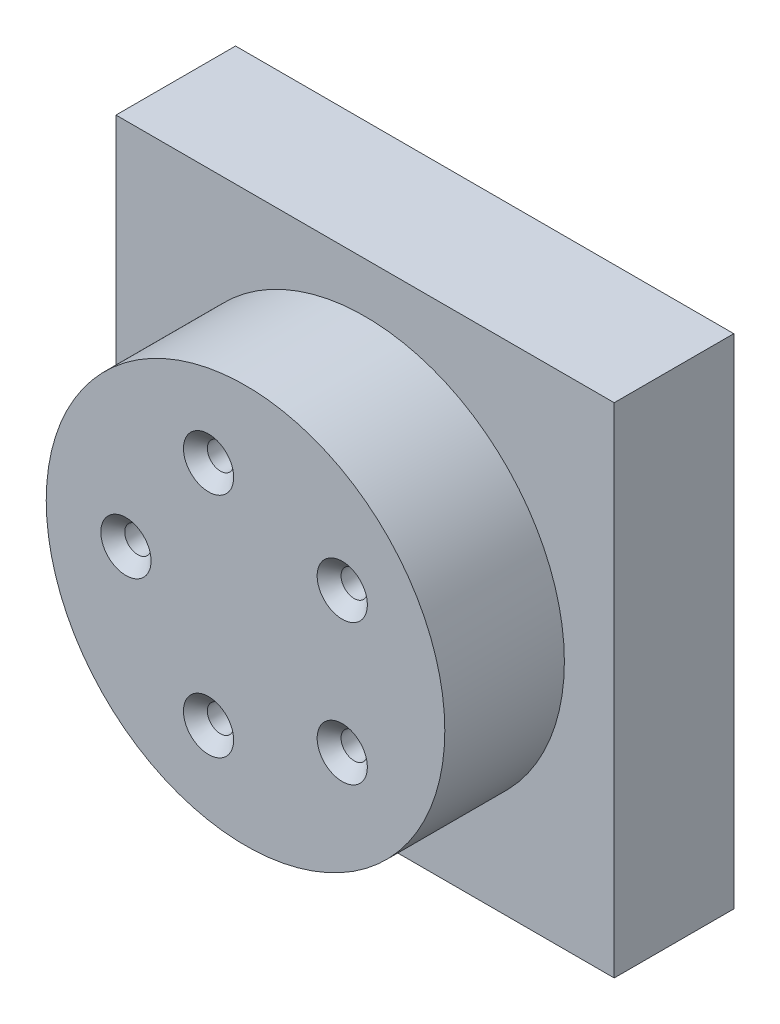
ISO-10303-21;
HEADER;
FILE_DESCRIPTION(('STEP AP214'),'2;1');
FILE_NAME('part.step','',(''),(''),'','','');
FILE_SCHEMA(('AUTOMOTIVE_DESIGN { 1 0 10303 214 1 1 1 1 }'));
ENDSEC;
DATA;
#1=APPLICATION_CONTEXT('core data for automotive mechanical design processes');
#2=APPLICATION_PROTOCOL_DEFINITION('international standard','automotive_design',2000,#1);
#3=PRODUCT_CONTEXT('',#1,'mechanical');
#4=PRODUCT('Part','Part','',(#3));
#5=PRODUCT_RELATED_PRODUCT_CATEGORY('part','',(#4));
#6=PRODUCT_DEFINITION_FORMATION('','',#4);
#7=PRODUCT_DEFINITION_CONTEXT('part definition',#1,'design');
#8=PRODUCT_DEFINITION('design','',#6,#7);
#9=PRODUCT_DEFINITION_SHAPE('','',#8);
#10=(LENGTH_UNIT() NAMED_UNIT(*) SI_UNIT(.MILLI.,.METRE.));
#11=(NAMED_UNIT(*) PLANE_ANGLE_UNIT() SI_UNIT($,.RADIAN.));
#12=(NAMED_UNIT(*) SI_UNIT($,.STERADIAN.) SOLID_ANGLE_UNIT());
#13=UNCERTAINTY_MEASURE_WITH_UNIT(LENGTH_MEASURE(1.E-05),#10,'distance_accuracy_value','');
#14=(GEOMETRIC_REPRESENTATION_CONTEXT(3) GLOBAL_UNCERTAINTY_ASSIGNED_CONTEXT((#13)) GLOBAL_UNIT_ASSIGNED_CONTEXT((#10,
#11,#12)) REPRESENTATION_CONTEXT('',''));
#15=CARTESIAN_POINT('',(0.,0.,0.));
#16=DIRECTION('',(0.,0.,1.));
#17=DIRECTION('',(1.,0.,0.));
#18=AXIS2_PLACEMENT_3D('',#15,#16,#17);
#19=CARTESIAN_POINT('',(-62.5,62.5,-30.));
#20=DIRECTION('',(-1.,0.,0.));
#21=DIRECTION('',(0.,-1.,0.));
#22=AXIS2_PLACEMENT_3D('',#19,#20,#21);
#23=PLANE('',#22);
#24=DIRECTION('',(0.,-1.,0.));
#25=VECTOR('',#24,1.);
#26=CARTESIAN_POINT('',(-62.5,62.5,0.));
#27=LINE('',#26,#25);
#28=CARTESIAN_POINT('',(-62.5,62.5,0.));
#29=VERTEX_POINT('',#28);
#30=CARTESIAN_POINT('',(-62.5,-62.5,0.));
#31=VERTEX_POINT('',#30);
#32=EDGE_CURVE('E112',#29,#31,#27,.T.);
#33=ORIENTED_EDGE('',*,*,#32,.F.);
#34=DIRECTION('',(0.,0.,1.));
#35=VECTOR('',#34,1.);
#36=CARTESIAN_POINT('',(-62.5,62.5,-30.));
#37=LINE('',#36,#35);
#38=CARTESIAN_POINT('',(-62.5,62.5,-30.));
#39=VERTEX_POINT('',#38);
#40=EDGE_CURVE('E49',#39,#29,#37,.T.);
#41=ORIENTED_EDGE('',*,*,#40,.F.);
#42=DIRECTION('',(0.,-1.,0.));
#43=VECTOR('',#42,1.);
#44=CARTESIAN_POINT('',(-62.5,62.5,-30.));
#45=LINE('',#44,#43);
#46=CARTESIAN_POINT('',(-62.5,-62.5,-30.));
#47=VERTEX_POINT('',#46);
#48=EDGE_CURVE('E105',#39,#47,#45,.T.);
#49=ORIENTED_EDGE('',*,*,#48,.T.);
#50=DIRECTION('',(0.,0.,1.));
#51=VECTOR('',#50,1.);
#52=CARTESIAN_POINT('',(-62.5,-62.5,-30.));
#53=LINE('',#52,#51);
#54=EDGE_CURVE('E42',#47,#31,#53,.T.);
#55=ORIENTED_EDGE('',*,*,#54,.T.);
#56=EDGE_LOOP('',(#33,#41,#49,#55));
#57=FACE_BOUND('',#56,.T.);
#58=ADVANCED_FACE('F39',(#57),#23,.T.);
#59=CARTESIAN_POINT('',(-62.5,62.5,-30.));
#60=DIRECTION('',(0.,-1.,0.));
#61=DIRECTION('',(0.,0.,-1.));
#62=AXIS2_PLACEMENT_3D('',#59,#60,#61);
#63=PLANE('',#62);
#64=DIRECTION('',(1.,0.,0.));
#65=VECTOR('',#64,1.);
#66=CARTESIAN_POINT('',(-62.5,62.5,0.));
#67=LINE('',#66,#65);
#68=CARTESIAN_POINT('',(62.5,62.5,0.));
#69=VERTEX_POINT('',#68);
#70=EDGE_CURVE('E74',#29,#69,#67,.T.);
#71=ORIENTED_EDGE('',*,*,#70,.T.);
#72=DIRECTION('',(0.,0.,1.));
#73=VECTOR('',#72,1.);
#74=CARTESIAN_POINT('',(62.5,62.5,-30.));
#75=LINE('',#74,#73);
#76=CARTESIAN_POINT('',(62.5,62.5,-30.));
#77=VERTEX_POINT('',#76);
#78=EDGE_CURVE('E102',#77,#69,#75,.T.);
#79=ORIENTED_EDGE('',*,*,#78,.F.);
#80=DIRECTION('',(1.,0.,0.));
#81=VECTOR('',#80,1.);
#82=CARTESIAN_POINT('',(-62.5,62.5,-30.));
#83=LINE('',#82,#81);
#84=EDGE_CURVE('E91',#39,#77,#83,.T.);
#85=ORIENTED_EDGE('',*,*,#84,.F.);
#86=ORIENTED_EDGE('',*,*,#40,.T.);
#87=EDGE_LOOP('',(#71,#79,#85,#86));
#88=FACE_BOUND('',#87,.T.);
#89=ADVANCED_FACE('F131',(#88),#63,.F.);
#90=CARTESIAN_POINT('',(62.5,62.5,-30.));
#91=DIRECTION('',(-1.,0.,0.));
#92=DIRECTION('',(0.,-1.,0.));
#93=AXIS2_PLACEMENT_3D('',#90,#91,#92);
#94=PLANE('',#93);
#95=DIRECTION('',(0.,-1.,0.));
#96=VECTOR('',#95,1.);
#97=CARTESIAN_POINT('',(62.5,62.5,0.));
#98=LINE('',#97,#96);
#99=CARTESIAN_POINT('',(62.5,-62.5,0.));
#100=VERTEX_POINT('',#99);
#101=EDGE_CURVE('E99',#69,#100,#98,.T.);
#102=ORIENTED_EDGE('',*,*,#101,.T.);
#103=DIRECTION('',(0.,0.,1.));
#104=VECTOR('',#103,1.);
#105=CARTESIAN_POINT('',(62.5,-62.5,-30.));
#106=LINE('',#105,#104);
#107=CARTESIAN_POINT('',(62.5,-62.5,-30.));
#108=VERTEX_POINT('',#107);
#109=EDGE_CURVE('E96',#108,#100,#106,.T.);
#110=ORIENTED_EDGE('',*,*,#109,.F.);
#111=DIRECTION('',(0.,-1.,0.));
#112=VECTOR('',#111,1.);
#113=CARTESIAN_POINT('',(62.5,62.5,-30.));
#114=LINE('',#113,#112);
#115=EDGE_CURVE('E86',#77,#108,#114,.T.);
#116=ORIENTED_EDGE('',*,*,#115,.F.);
#117=ORIENTED_EDGE('',*,*,#78,.T.);
#118=EDGE_LOOP('',(#102,#110,#116,#117));
#119=FACE_BOUND('',#118,.T.);
#120=ADVANCED_FACE('F97',(#119),#94,.F.);
#121=CARTESIAN_POINT('',(-62.5,-62.5,-30.));
#122=DIRECTION('',(0.,-1.,0.));
#123=DIRECTION('',(0.,0.,-1.));
#124=AXIS2_PLACEMENT_3D('',#121,#122,#123);
#125=PLANE('',#124);
#126=DIRECTION('',(1.,0.,0.));
#127=VECTOR('',#126,1.);
#128=CARTESIAN_POINT('',(-62.5,-62.5,0.));
#129=LINE('',#128,#127);
#130=EDGE_CURVE('E116',#31,#100,#129,.T.);
#131=ORIENTED_EDGE('',*,*,#130,.F.);
#132=ORIENTED_EDGE('',*,*,#54,.F.);
#133=DIRECTION('',(1.,0.,0.));
#134=VECTOR('',#133,1.);
#135=CARTESIAN_POINT('',(-62.5,-62.5,-30.));
#136=LINE('',#135,#134);
#137=EDGE_CURVE('E90',#47,#108,#136,.T.);
#138=ORIENTED_EDGE('',*,*,#137,.T.);
#139=ORIENTED_EDGE('',*,*,#109,.T.);
#140=EDGE_LOOP('',(#131,#132,#138,#139));
#141=FACE_BOUND('',#140,.T.);
#142=ADVANCED_FACE('F103',(#141),#125,.T.);
#143=CARTESIAN_POINT('',(0.,0.,-30.));
#144=DIRECTION('',(0.,0.,1.));
#145=DIRECTION('',(1.,0.,0.));
#146=AXIS2_PLACEMENT_3D('',#143,#144,#145);
#147=PLANE('',#146);
#148=CARTESIAN_POINT('',(-9.27050983124875,28.5316954888545,-30.));
#149=DIRECTION('',(0.,0.,1.));
#150=DIRECTION('',(1.,0.,0.));
#151=AXIS2_PLACEMENT_3D('',#148,#149,#150);
#152=CIRCLE('',#151,3.29999999999998);
#153=CARTESIAN_POINT('',(-5.97050983124877,28.5316954888545,-30.));
#154=VERTEX_POINT('',#153);
#155=EDGE_CURVE('E213',#154,#154,#152,.T.);
#156=ORIENTED_EDGE('',*,*,#155,.T.);
#157=EDGE_LOOP('',(#156));
#158=FACE_BOUND('',#157,.T.);
#159=CARTESIAN_POINT('',(24.2705098312483,17.6335575687744,-30.));
#160=DIRECTION('',(0.,0.,1.));
#161=DIRECTION('',(1.,0.,0.));
#162=AXIS2_PLACEMENT_3D('',#159,#160,#161);
#163=CIRCLE('',#162,3.29999999999998);
#164=CARTESIAN_POINT('',(27.5705098312482,17.6335575687744,-30.));
#165=VERTEX_POINT('',#164);
#166=EDGE_CURVE('E226',#165,#165,#163,.T.);
#167=ORIENTED_EDGE('',*,*,#166,.T.);
#168=EDGE_LOOP('',(#167));
#169=FACE_BOUND('',#168,.T.);
#170=CARTESIAN_POINT('',(24.2705098312485,-17.6335575687741,-30.));
#171=DIRECTION('',(0.,0.,1.));
#172=DIRECTION('',(1.,0.,0.));
#173=AXIS2_PLACEMENT_3D('',#170,#171,#172);
#174=CIRCLE('',#173,3.29999999999998);
#175=CARTESIAN_POINT('',(27.5705098312485,-17.6335575687741,-30.));
#176=VERTEX_POINT('',#175);
#177=EDGE_CURVE('E238',#176,#176,#174,.T.);
#178=ORIENTED_EDGE('',*,*,#177,.T.);
#179=EDGE_LOOP('',(#178));
#180=FACE_BOUND('',#179,.T.);
#181=CARTESIAN_POINT('',(-9.27050983124834,-28.5316954888546,-30.));
#182=DIRECTION('',(0.,0.,1.));
#183=DIRECTION('',(1.,0.,0.));
#184=AXIS2_PLACEMENT_3D('',#181,#182,#183);
#185=CIRCLE('',#184,3.29999999999998);
#186=CARTESIAN_POINT('',(-5.97050983124836,-28.5316954888546,-30.));
#187=VERTEX_POINT('',#186);
#188=EDGE_CURVE('E250',#187,#187,#185,.T.);
#189=ORIENTED_EDGE('',*,*,#188,.T.);
#190=EDGE_LOOP('',(#189));
#191=FACE_BOUND('',#190,.T.);
#192=CARTESIAN_POINT('',(-30.,0.,-30.));
#193=DIRECTION('',(0.,0.,1.));
#194=DIRECTION('',(1.,0.,0.));
#195=AXIS2_PLACEMENT_3D('',#192,#193,#194);
#196=CIRCLE('',#195,3.29999999999998);
#197=CARTESIAN_POINT('',(-26.7,0.,-30.));
#198=VERTEX_POINT('',#197);
#199=EDGE_CURVE('E262',#198,#198,#196,.T.);
#200=ORIENTED_EDGE('',*,*,#199,.T.);
#201=EDGE_LOOP('',(#200));
#202=FACE_BOUND('',#201,.T.);
#203=ORIENTED_EDGE('',*,*,#48,.F.);
#204=ORIENTED_EDGE('',*,*,#84,.T.);
#205=ORIENTED_EDGE('',*,*,#115,.T.);
#206=ORIENTED_EDGE('',*,*,#137,.F.);
#207=EDGE_LOOP('',(#203,#204,#205,#206));
#208=FACE_BOUND('',#207,.T.);
#209=ADVANCED_FACE('F89',(#158,#169,#180,#191,#202,#208),#147,.F.);
#210=CARTESIAN_POINT('',(0.,0.,0.));
#211=DIRECTION('',(0.,0.,1.));
#212=DIRECTION('',(1.,0.,0.));
#213=AXIS2_PLACEMENT_3D('',#210,#211,#212);
#214=PLANE('',#213);
#215=CARTESIAN_POINT('',(0.,0.,0.));
#216=DIRECTION('',(0.,0.,1.));
#217=DIRECTION('',(1.,0.,0.));
#218=AXIS2_PLACEMENT_3D('',#215,#216,#217);
#219=CIRCLE('',#218,50.);
#220=CARTESIAN_POINT('',(50.,0.,0.));
#221=VERTEX_POINT('',#220);
#222=EDGE_CURVE('E11',#221,#221,#219,.T.);
#223=ORIENTED_EDGE('',*,*,#222,.F.);
#224=EDGE_LOOP('',(#223));
#225=FACE_BOUND('',#224,.T.);
#226=ORIENTED_EDGE('',*,*,#32,.T.);
#227=ORIENTED_EDGE('',*,*,#130,.T.);
#228=ORIENTED_EDGE('',*,*,#101,.F.);
#229=ORIENTED_EDGE('',*,*,#70,.F.);
#230=EDGE_LOOP('',(#226,#227,#228,#229));
#231=FACE_BOUND('',#230,.T.);
#232=ADVANCED_FACE('F128',(#225,#231),#214,.T.);
#233=CARTESIAN_POINT('',(0.,0.,30.));
#234=DIRECTION('',(0.,0.,-1.));
#235=DIRECTION('',(-1.,0.,0.));
#236=AXIS2_PLACEMENT_3D('',#233,#234,#235);
#237=CYLINDRICAL_SURFACE('',#236,50.);
#238=CARTESIAN_POINT('',(0.,0.,30.));
#239=DIRECTION('',(0.,0.,1.));
#240=DIRECTION('',(1.,0.,0.));
#241=AXIS2_PLACEMENT_3D('',#238,#239,#240);
#242=CIRCLE('',#241,50.);
#243=CARTESIAN_POINT('',(50.,0.,30.));
#244=VERTEX_POINT('',#243);
#245=EDGE_CURVE('E117',#244,#244,#242,.T.);
#246=ORIENTED_EDGE('',*,*,#245,.F.);
#247=EDGE_LOOP('',(#246));
#248=FACE_BOUND('',#247,.T.);
#249=ORIENTED_EDGE('',*,*,#222,.T.);
#250=EDGE_LOOP('',(#249));
#251=FACE_BOUND('',#250,.T.);
#252=ADVANCED_FACE('F150',(#248,#251),#237,.T.);
#253=CARTESIAN_POINT('',(0.,0.,30.));
#254=DIRECTION('',(0.,0.,1.));
#255=DIRECTION('',(1.,0.,0.));
#256=AXIS2_PLACEMENT_3D('',#253,#254,#255);
#257=PLANE('',#256);
#258=CARTESIAN_POINT('',(-9.27050983124875,28.5316954888545,30.));
#259=DIRECTION('',(0.,0.,1.));
#260=DIRECTION('',(1.,0.,0.));
#261=AXIS2_PLACEMENT_3D('',#258,#259,#260);
#262=CIRCLE('',#261,6.3);
#263=CARTESIAN_POINT('',(-2.97050983124875,28.5316954888545,30.));
#264=VERTEX_POINT('',#263);
#265=EDGE_CURVE('E209',#264,#264,#262,.T.);
#266=ORIENTED_EDGE('',*,*,#265,.F.);
#267=EDGE_LOOP('',(#266));
#268=FACE_BOUND('',#267,.T.);
#269=CARTESIAN_POINT('',(24.2705098312483,17.6335575687744,30.));
#270=DIRECTION('',(0.,0.,1.));
#271=DIRECTION('',(1.,0.,0.));
#272=AXIS2_PLACEMENT_3D('',#269,#270,#271);
#273=CIRCLE('',#272,6.3);
#274=CARTESIAN_POINT('',(30.5705098312483,17.6335575687744,30.));
#275=VERTEX_POINT('',#274);
#276=EDGE_CURVE('E218',#275,#275,#273,.T.);
#277=ORIENTED_EDGE('',*,*,#276,.F.);
#278=EDGE_LOOP('',(#277));
#279=FACE_BOUND('',#278,.T.);
#280=CARTESIAN_POINT('',(24.2705098312485,-17.6335575687741,30.));
#281=DIRECTION('',(0.,0.,1.));
#282=DIRECTION('',(1.,0.,0.));
#283=AXIS2_PLACEMENT_3D('',#280,#281,#282);
#284=CIRCLE('',#283,6.3);
#285=CARTESIAN_POINT('',(30.5705098312485,-17.6335575687741,30.));
#286=VERTEX_POINT('',#285);
#287=EDGE_CURVE('E230',#286,#286,#284,.T.);
#288=ORIENTED_EDGE('',*,*,#287,.F.);
#289=EDGE_LOOP('',(#288));
#290=FACE_BOUND('',#289,.T.);
#291=CARTESIAN_POINT('',(-9.27050983124834,-28.5316954888546,30.));
#292=DIRECTION('',(0.,0.,1.));
#293=DIRECTION('',(1.,0.,0.));
#294=AXIS2_PLACEMENT_3D('',#291,#292,#293);
#295=CIRCLE('',#294,6.3);
#296=CARTESIAN_POINT('',(-2.97050983124834,-28.5316954888546,30.));
#297=VERTEX_POINT('',#296);
#298=EDGE_CURVE('E242',#297,#297,#295,.T.);
#299=ORIENTED_EDGE('',*,*,#298,.F.);
#300=EDGE_LOOP('',(#299));
#301=FACE_BOUND('',#300,.T.);
#302=CARTESIAN_POINT('',(-30.,0.,30.));
#303=DIRECTION('',(0.,0.,1.));
#304=DIRECTION('',(1.,0.,0.));
#305=AXIS2_PLACEMENT_3D('',#302,#303,#304);
#306=CIRCLE('',#305,6.3);
#307=CARTESIAN_POINT('',(-23.7,0.,30.));
#308=VERTEX_POINT('',#307);
#309=EDGE_CURVE('E254',#308,#308,#306,.T.);
#310=ORIENTED_EDGE('',*,*,#309,.F.);
#311=EDGE_LOOP('',(#310));
#312=FACE_BOUND('',#311,.T.);
#313=ORIENTED_EDGE('',*,*,#245,.T.);
#314=EDGE_LOOP('',(#313));
#315=FACE_BOUND('',#314,.T.);
#316=ADVANCED_FACE('F157',(#268,#279,#290,#301,#312,#315),#257,.T.);
#317=CARTESIAN_POINT('',(-30.,0.,30.));
#318=DIRECTION('',(0.,0.,1.));
#319=DIRECTION('',(1.,0.,0.));
#320=AXIS2_PLACEMENT_3D('',#317,#318,#319);
#321=CYLINDRICAL_SURFACE('',#320,3.29999999999999);
#322=ORIENTED_EDGE('',*,*,#199,.F.);
#323=EDGE_LOOP('',(#322));
#324=FACE_BOUND('',#323,.T.);
#325=CARTESIAN_POINT('',(-30.,0.,27.));
#326=DIRECTION('',(0.,0.,1.));
#327=DIRECTION('',(1.,0.,0.));
#328=AXIS2_PLACEMENT_3D('',#325,#326,#327);
#329=CIRCLE('',#328,3.29999999999999);
#330=CARTESIAN_POINT('',(-26.7,0.,27.));
#331=VERTEX_POINT('',#330);
#332=EDGE_CURVE('E258',#331,#331,#329,.T.);
#333=ORIENTED_EDGE('',*,*,#332,.T.);
#334=EDGE_LOOP('',(#333));
#335=FACE_BOUND('',#334,.T.);
#336=ADVANCED_FACE('F161',(#324,#335),#321,.F.);
#337=CARTESIAN_POINT('',(-30.,0.,30.));
#338=DIRECTION('',(0.,0.,1.));
#339=DIRECTION('',(1.,0.,0.));
#340=AXIS2_PLACEMENT_3D('',#337,#338,#339);
#341=CONICAL_SURFACE('',#340,6.3,0.785398163397448);
#342=ORIENTED_EDGE('',*,*,#332,.F.);
#343=EDGE_LOOP('',(#342));
#344=FACE_BOUND('',#343,.T.);
#345=ORIENTED_EDGE('',*,*,#309,.T.);
#346=EDGE_LOOP('',(#345));
#347=FACE_BOUND('',#346,.T.);
#348=ADVANCED_FACE('F165',(#344,#347),#341,.F.);
#349=CARTESIAN_POINT('',(-9.27050983124834,-28.5316954888546,30.));
#350=DIRECTION('',(0.,0.,1.));
#351=DIRECTION('',(1.,0.,0.));
#352=AXIS2_PLACEMENT_3D('',#349,#350,#351);
#353=CYLINDRICAL_SURFACE('',#352,3.29999999999999);
#354=ORIENTED_EDGE('',*,*,#188,.F.);
#355=EDGE_LOOP('',(#354));
#356=FACE_BOUND('',#355,.T.);
#357=CARTESIAN_POINT('',(-9.27050983124834,-28.5316954888546,27.));
#358=DIRECTION('',(0.,0.,1.));
#359=DIRECTION('',(1.,0.,0.));
#360=AXIS2_PLACEMENT_3D('',#357,#358,#359);
#361=CIRCLE('',#360,3.29999999999999);
#362=CARTESIAN_POINT('',(-5.97050983124835,-28.5316954888546,27.));
#363=VERTEX_POINT('',#362);
#364=EDGE_CURVE('E246',#363,#363,#361,.T.);
#365=ORIENTED_EDGE('',*,*,#364,.T.);
#366=EDGE_LOOP('',(#365));
#367=FACE_BOUND('',#366,.T.);
#368=ADVANCED_FACE('F169',(#356,#367),#353,.F.);
#369=CARTESIAN_POINT('',(-9.27050983124834,-28.5316954888546,30.));
#370=DIRECTION('',(0.,0.,1.));
#371=DIRECTION('',(1.,0.,0.));
#372=AXIS2_PLACEMENT_3D('',#369,#370,#371);
#373=CONICAL_SURFACE('',#372,6.3,0.785398163397448);
#374=ORIENTED_EDGE('',*,*,#364,.F.);
#375=EDGE_LOOP('',(#374));
#376=FACE_BOUND('',#375,.T.);
#377=ORIENTED_EDGE('',*,*,#298,.T.);
#378=EDGE_LOOP('',(#377));
#379=FACE_BOUND('',#378,.T.);
#380=ADVANCED_FACE('F173',(#376,#379),#373,.F.);
#381=CARTESIAN_POINT('',(24.2705098312485,-17.6335575687741,30.));
#382=DIRECTION('',(0.,0.,1.));
#383=DIRECTION('',(1.,0.,0.));
#384=AXIS2_PLACEMENT_3D('',#381,#382,#383);
#385=CYLINDRICAL_SURFACE('',#384,3.29999999999999);
#386=ORIENTED_EDGE('',*,*,#177,.F.);
#387=EDGE_LOOP('',(#386));
#388=FACE_BOUND('',#387,.T.);
#389=CARTESIAN_POINT('',(24.2705098312485,-17.6335575687741,27.));
#390=DIRECTION('',(0.,0.,1.));
#391=DIRECTION('',(1.,0.,0.));
#392=AXIS2_PLACEMENT_3D('',#389,#390,#391);
#393=CIRCLE('',#392,3.29999999999999);
#394=CARTESIAN_POINT('',(27.5705098312485,-17.6335575687741,27.));
#395=VERTEX_POINT('',#394);
#396=EDGE_CURVE('E234',#395,#395,#393,.T.);
#397=ORIENTED_EDGE('',*,*,#396,.T.);
#398=EDGE_LOOP('',(#397));
#399=FACE_BOUND('',#398,.T.);
#400=ADVANCED_FACE('F177',(#388,#399),#385,.F.);
#401=CARTESIAN_POINT('',(24.2705098312485,-17.6335575687741,30.));
#402=DIRECTION('',(0.,0.,1.));
#403=DIRECTION('',(1.,0.,0.));
#404=AXIS2_PLACEMENT_3D('',#401,#402,#403);
#405=CONICAL_SURFACE('',#404,6.3,0.785398163397448);
#406=ORIENTED_EDGE('',*,*,#396,.F.);
#407=EDGE_LOOP('',(#406));
#408=FACE_BOUND('',#407,.T.);
#409=ORIENTED_EDGE('',*,*,#287,.T.);
#410=EDGE_LOOP('',(#409));
#411=FACE_BOUND('',#410,.T.);
#412=ADVANCED_FACE('F181',(#408,#411),#405,.F.);
#413=CARTESIAN_POINT('',(24.2705098312483,17.6335575687744,30.));
#414=DIRECTION('',(0.,0.,1.));
#415=DIRECTION('',(1.,0.,0.));
#416=AXIS2_PLACEMENT_3D('',#413,#414,#415);
#417=CYLINDRICAL_SURFACE('',#416,3.29999999999999);
#418=ORIENTED_EDGE('',*,*,#166,.F.);
#419=EDGE_LOOP('',(#418));
#420=FACE_BOUND('',#419,.T.);
#421=CARTESIAN_POINT('',(24.2705098312483,17.6335575687744,27.));
#422=DIRECTION('',(0.,0.,1.));
#423=DIRECTION('',(1.,0.,0.));
#424=AXIS2_PLACEMENT_3D('',#421,#422,#423);
#425=CIRCLE('',#424,3.29999999999999);
#426=CARTESIAN_POINT('',(27.5705098312483,17.6335575687744,27.));
#427=VERTEX_POINT('',#426);
#428=EDGE_CURVE('E222',#427,#427,#425,.T.);
#429=ORIENTED_EDGE('',*,*,#428,.T.);
#430=EDGE_LOOP('',(#429));
#431=FACE_BOUND('',#430,.T.);
#432=ADVANCED_FACE('F185',(#420,#431),#417,.F.);
#433=CARTESIAN_POINT('',(24.2705098312483,17.6335575687744,30.));
#434=DIRECTION('',(0.,0.,1.));
#435=DIRECTION('',(1.,0.,0.));
#436=AXIS2_PLACEMENT_3D('',#433,#434,#435);
#437=CONICAL_SURFACE('',#436,6.3,0.785398163397448);
#438=ORIENTED_EDGE('',*,*,#428,.F.);
#439=EDGE_LOOP('',(#438));
#440=FACE_BOUND('',#439,.T.);
#441=ORIENTED_EDGE('',*,*,#276,.T.);
#442=EDGE_LOOP('',(#441));
#443=FACE_BOUND('',#442,.T.);
#444=ADVANCED_FACE('F189',(#440,#443),#437,.F.);
#445=CARTESIAN_POINT('',(-9.27050983124875,28.5316954888545,30.));
#446=DIRECTION('',(0.,0.,1.));
#447=DIRECTION('',(1.,0.,0.));
#448=AXIS2_PLACEMENT_3D('',#445,#446,#447);
#449=CYLINDRICAL_SURFACE('',#448,3.29999999999999);
#450=ORIENTED_EDGE('',*,*,#155,.F.);
#451=EDGE_LOOP('',(#450));
#452=FACE_BOUND('',#451,.T.);
#453=CARTESIAN_POINT('',(-9.27050983124875,28.5316954888545,27.));
#454=DIRECTION('',(0.,0.,1.));
#455=DIRECTION('',(1.,0.,0.));
#456=AXIS2_PLACEMENT_3D('',#453,#454,#455);
#457=CIRCLE('',#456,3.29999999999999);
#458=CARTESIAN_POINT('',(-5.97050983124875,28.5316954888545,27.));
#459=VERTEX_POINT('',#458);
#460=EDGE_CURVE('E206',#459,#459,#457,.T.);
#461=ORIENTED_EDGE('',*,*,#460,.T.);
#462=EDGE_LOOP('',(#461));
#463=FACE_BOUND('',#462,.T.);
#464=ADVANCED_FACE('F193',(#452,#463),#449,.F.);
#465=CARTESIAN_POINT('',(-9.27050983124875,28.5316954888545,30.));
#466=DIRECTION('',(0.,0.,1.));
#467=DIRECTION('',(1.,0.,0.));
#468=AXIS2_PLACEMENT_3D('',#465,#466,#467);
#469=CONICAL_SURFACE('',#468,6.3,0.785398163397448);
#470=ORIENTED_EDGE('',*,*,#460,.F.);
#471=EDGE_LOOP('',(#470));
#472=FACE_BOUND('',#471,.T.);
#473=ORIENTED_EDGE('',*,*,#265,.T.);
#474=EDGE_LOOP('',(#473));
#475=FACE_BOUND('',#474,.T.);
#476=ADVANCED_FACE('F197',(#472,#475),#469,.F.);
#477=CLOSED_SHELL('',(#58,#89,#120,#142,#209,#232,#252,#316,#336,#348,#368,#380,#400,#412,#432,
#444,#464,#476));
#478=MANIFOLD_SOLID_BREP('B2',#477);
#479=ADVANCED_BREP_SHAPE_REPRESENTATION('',(#18,#478),#14);
#480=SHAPE_DEFINITION_REPRESENTATION(#9,#479);
ENDSEC;
END-ISO-10303-21;
